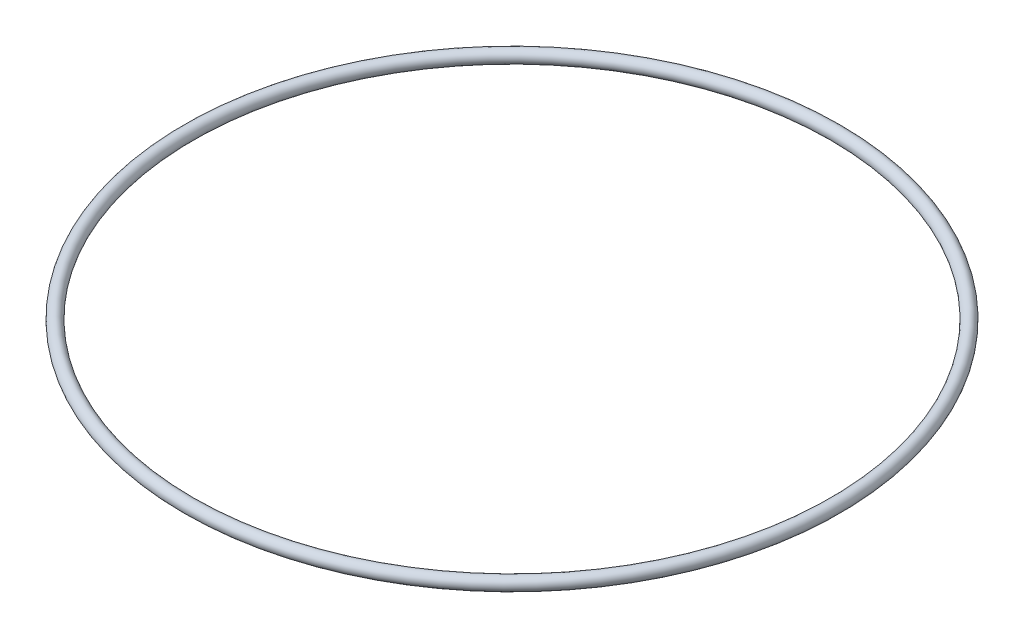
ISO-10303-21;
HEADER;
FILE_DESCRIPTION(('STEP AP214'),'2;1');
FILE_NAME('part.step','',(''),(''),'','','');
FILE_SCHEMA(('AUTOMOTIVE_DESIGN { 1 0 10303 214 1 1 1 1 }'));
ENDSEC;
DATA;
#1=APPLICATION_CONTEXT('core data for automotive mechanical design processes');
#2=APPLICATION_PROTOCOL_DEFINITION('international standard','automotive_design',2000,#1);
#3=PRODUCT_CONTEXT('',#1,'mechanical');
#4=PRODUCT('Part','Part','',(#3));
#5=PRODUCT_RELATED_PRODUCT_CATEGORY('part','',(#4));
#6=PRODUCT_DEFINITION_FORMATION('','',#4);
#7=PRODUCT_DEFINITION_CONTEXT('part definition',#1,'design');
#8=PRODUCT_DEFINITION('design','',#6,#7);
#9=PRODUCT_DEFINITION_SHAPE('','',#8);
#10=(LENGTH_UNIT() NAMED_UNIT(*) SI_UNIT(.MILLI.,.METRE.));
#11=(NAMED_UNIT(*) PLANE_ANGLE_UNIT() SI_UNIT($,.RADIAN.));
#12=(NAMED_UNIT(*) SI_UNIT($,.STERADIAN.) SOLID_ANGLE_UNIT());
#13=UNCERTAINTY_MEASURE_WITH_UNIT(LENGTH_MEASURE(1.E-05),#10,'distance_accuracy_value','');
#14=(GEOMETRIC_REPRESENTATION_CONTEXT(3) GLOBAL_UNCERTAINTY_ASSIGNED_CONTEXT((#13)) GLOBAL_UNIT_ASSIGNED_CONTEXT((#10,
#11,#12)) REPRESENTATION_CONTEXT('',''));
#15=CARTESIAN_POINT('',(0.,0.,0.));
#16=DIRECTION('',(0.,0.,1.));
#17=DIRECTION('',(1.,0.,0.));
#18=AXIS2_PLACEMENT_3D('',#15,#16,#17);
#19=CARTESIAN_POINT('',(0.,0.,0.));
#20=DIRECTION('',(0.,-1.,0.));
#21=DIRECTION('',(0.,0.,-1.));
#22=AXIS2_PLACEMENT_3D('',#19,#20,#21);
#23=TOROIDAL_SURFACE('',#22,41.91,0.825500000000003);
#24=CARTESIAN_POINT('',(0.,0.,-42.7355));
#25=VERTEX_POINT('',#24);
#26=VERTEX_LOOP('',#25);
#27=FACE_BOUND('',#26,.T.);
#28=ADVANCED_FACE('F30',(#27),#23,.T.);
#29=CLOSED_SHELL('',(#28));
#30=MANIFOLD_SOLID_BREP('B2',#29);
#31=ADVANCED_BREP_SHAPE_REPRESENTATION('',(#18,#30),#14);
#32=SHAPE_DEFINITION_REPRESENTATION(#9,#31);
ENDSEC;
END-ISO-10303-21;
